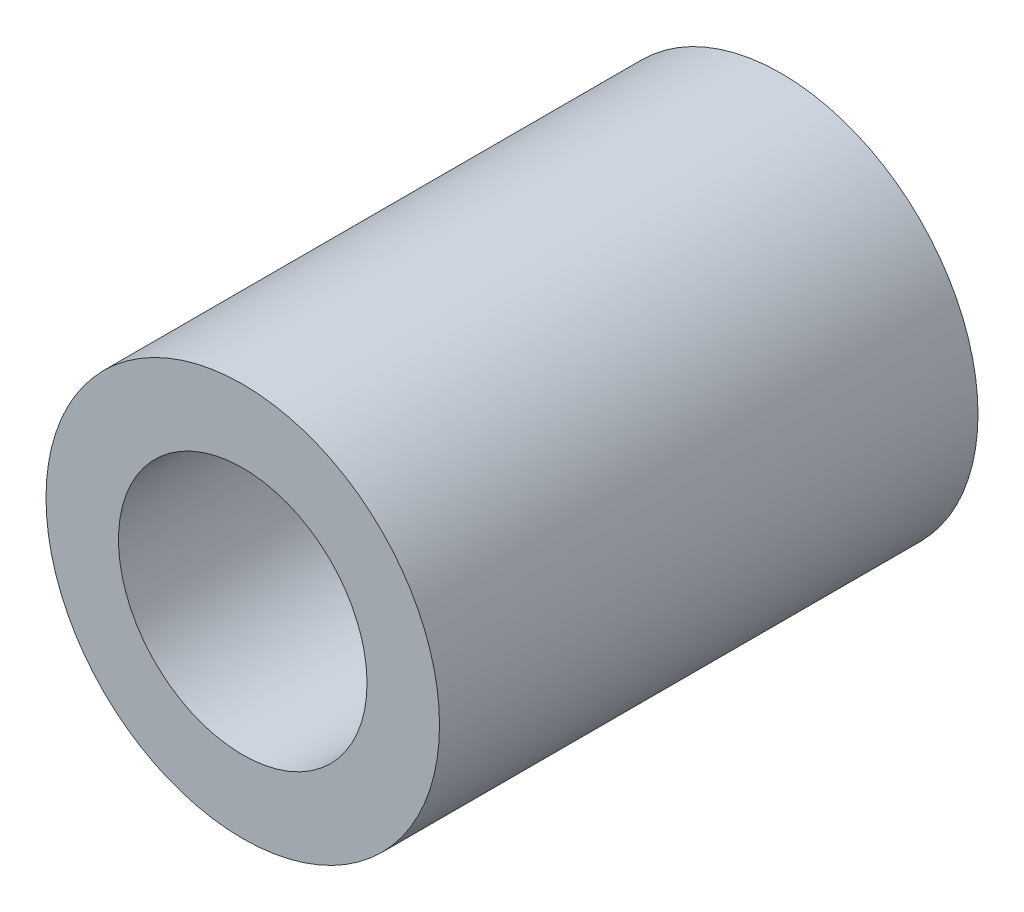
ISO-10303-21;
HEADER;
FILE_DESCRIPTION(('STEP AP214'),'2;1');
FILE_NAME('part.step','',(''),(''),'','','');
FILE_SCHEMA(('AUTOMOTIVE_DESIGN { 1 0 10303 214 1 1 1 1 }'));
ENDSEC;
DATA;
#1=APPLICATION_CONTEXT('core data for automotive mechanical design processes');
#2=APPLICATION_PROTOCOL_DEFINITION('international standard','automotive_design',2000,#1);
#3=PRODUCT_CONTEXT('',#1,'mechanical');
#4=PRODUCT('Part','Part','',(#3));
#5=PRODUCT_RELATED_PRODUCT_CATEGORY('part','',(#4));
#6=PRODUCT_DEFINITION_FORMATION('','',#4);
#7=PRODUCT_DEFINITION_CONTEXT('part definition',#1,'design');
#8=PRODUCT_DEFINITION('design','',#6,#7);
#9=PRODUCT_DEFINITION_SHAPE('','',#8);
#10=(LENGTH_UNIT() NAMED_UNIT(*) SI_UNIT(.MILLI.,.METRE.));
#11=(NAMED_UNIT(*) PLANE_ANGLE_UNIT() SI_UNIT($,.RADIAN.));
#12=(NAMED_UNIT(*) SI_UNIT($,.STERADIAN.) SOLID_ANGLE_UNIT());
#13=UNCERTAINTY_MEASURE_WITH_UNIT(LENGTH_MEASURE(1.E-05),#10,'distance_accuracy_value','');
#14=(GEOMETRIC_REPRESENTATION_CONTEXT(3) GLOBAL_UNCERTAINTY_ASSIGNED_CONTEXT((#13)) GLOBAL_UNIT_ASSIGNED_CONTEXT((#10,
#11,#12)) REPRESENTATION_CONTEXT('',''));
#15=CARTESIAN_POINT('',(0.,0.,0.));
#16=DIRECTION('',(0.,0.,1.));
#17=DIRECTION('',(1.,0.,0.));
#18=AXIS2_PLACEMENT_3D('',#15,#16,#17);
#19=CARTESIAN_POINT('',(0.,0.,13.));
#20=DIRECTION('',(0.,0.,1.));
#21=DIRECTION('',(1.,0.,0.));
#22=AXIS2_PLACEMENT_3D('',#19,#20,#21);
#23=PLANE('',#22);
#24=CARTESIAN_POINT('',(0.,0.,13.));
#25=DIRECTION('',(0.,0.,1.));
#26=DIRECTION('',(1.,0.,0.));
#27=AXIS2_PLACEMENT_3D('',#24,#25,#26);
#28=CIRCLE('',#27,4.75);
#29=CARTESIAN_POINT('',(4.75,0.,13.));
#30=VERTEX_POINT('',#29);
#31=EDGE_CURVE('E10',#30,#30,#28,.T.);
#32=ORIENTED_EDGE('',*,*,#31,.T.);
#33=EDGE_LOOP('',(#32));
#34=FACE_BOUND('',#33,.T.);
#35=CARTESIAN_POINT('',(0.,0.,13.));
#36=DIRECTION('',(0.,0.,1.));
#37=DIRECTION('',(1.,0.,0.));
#38=AXIS2_PLACEMENT_3D('',#35,#36,#37);
#39=CIRCLE('',#38,3.);
#40=CARTESIAN_POINT('',(3.,0.,13.));
#41=VERTEX_POINT('',#40);
#42=EDGE_CURVE('E43',#41,#41,#39,.T.);
#43=ORIENTED_EDGE('',*,*,#42,.F.);
#44=EDGE_LOOP('',(#43));
#45=FACE_BOUND('',#44,.T.);
#46=ADVANCED_FACE('F32',(#34,#45),#23,.T.);
#47=CARTESIAN_POINT('',(0.,0.,0.));
#48=DIRECTION('',(0.,0.,1.));
#49=DIRECTION('',(1.,0.,0.));
#50=AXIS2_PLACEMENT_3D('',#47,#48,#49);
#51=PLANE('',#50);
#52=CARTESIAN_POINT('',(0.,0.,0.));
#53=DIRECTION('',(0.,0.,1.));
#54=DIRECTION('',(1.,0.,0.));
#55=AXIS2_PLACEMENT_3D('',#52,#53,#54);
#56=CIRCLE('',#55,4.75);
#57=CARTESIAN_POINT('',(4.75,0.,0.));
#58=VERTEX_POINT('',#57);
#59=EDGE_CURVE('E36',#58,#58,#56,.T.);
#60=ORIENTED_EDGE('',*,*,#59,.F.);
#61=EDGE_LOOP('',(#60));
#62=FACE_BOUND('',#61,.T.);
#63=CARTESIAN_POINT('',(0.,0.,0.));
#64=DIRECTION('',(0.,0.,1.));
#65=DIRECTION('',(1.,0.,0.));
#66=AXIS2_PLACEMENT_3D('',#63,#64,#65);
#67=CIRCLE('',#66,3.);
#68=CARTESIAN_POINT('',(3.,0.,0.));
#69=VERTEX_POINT('',#68);
#70=EDGE_CURVE('E45',#69,#69,#67,.T.);
#71=ORIENTED_EDGE('',*,*,#70,.T.);
#72=EDGE_LOOP('',(#71));
#73=FACE_BOUND('',#72,.T.);
#74=ADVANCED_FACE('F55',(#62,#73),#51,.F.);
#75=CARTESIAN_POINT('',(0.,0.,13.));
#76=DIRECTION('',(0.,0.,-1.));
#77=DIRECTION('',(-1.,0.,0.));
#78=AXIS2_PLACEMENT_3D('',#75,#76,#77);
#79=CYLINDRICAL_SURFACE('',#78,4.75);
#80=ORIENTED_EDGE('',*,*,#31,.F.);
#81=EDGE_LOOP('',(#80));
#82=FACE_BOUND('',#81,.T.);
#83=ORIENTED_EDGE('',*,*,#59,.T.);
#84=EDGE_LOOP('',(#83));
#85=FACE_BOUND('',#84,.T.);
#86=ADVANCED_FACE('F34',(#82,#85),#79,.T.);
#87=CARTESIAN_POINT('',(0.,0.,13.));
#88=DIRECTION('',(0.,0.,-1.));
#89=DIRECTION('',(-1.,0.,0.));
#90=AXIS2_PLACEMENT_3D('',#87,#88,#89);
#91=CYLINDRICAL_SURFACE('',#90,3.);
#92=ORIENTED_EDGE('',*,*,#42,.T.);
#93=EDGE_LOOP('',(#92));
#94=FACE_BOUND('',#93,.T.);
#95=ORIENTED_EDGE('',*,*,#70,.F.);
#96=EDGE_LOOP('',(#95));
#97=FACE_BOUND('',#96,.T.);
#98=ADVANCED_FACE('F51',(#94,#97),#91,.F.);
#99=CLOSED_SHELL('',(#46,#74,#86,#98));
#100=MANIFOLD_SOLID_BREP('B2',#99);
#101=ADVANCED_BREP_SHAPE_REPRESENTATION('',(#18,#100),#14);
#102=SHAPE_DEFINITION_REPRESENTATION(#9,#101);
ENDSEC;
END-ISO-10303-21;
